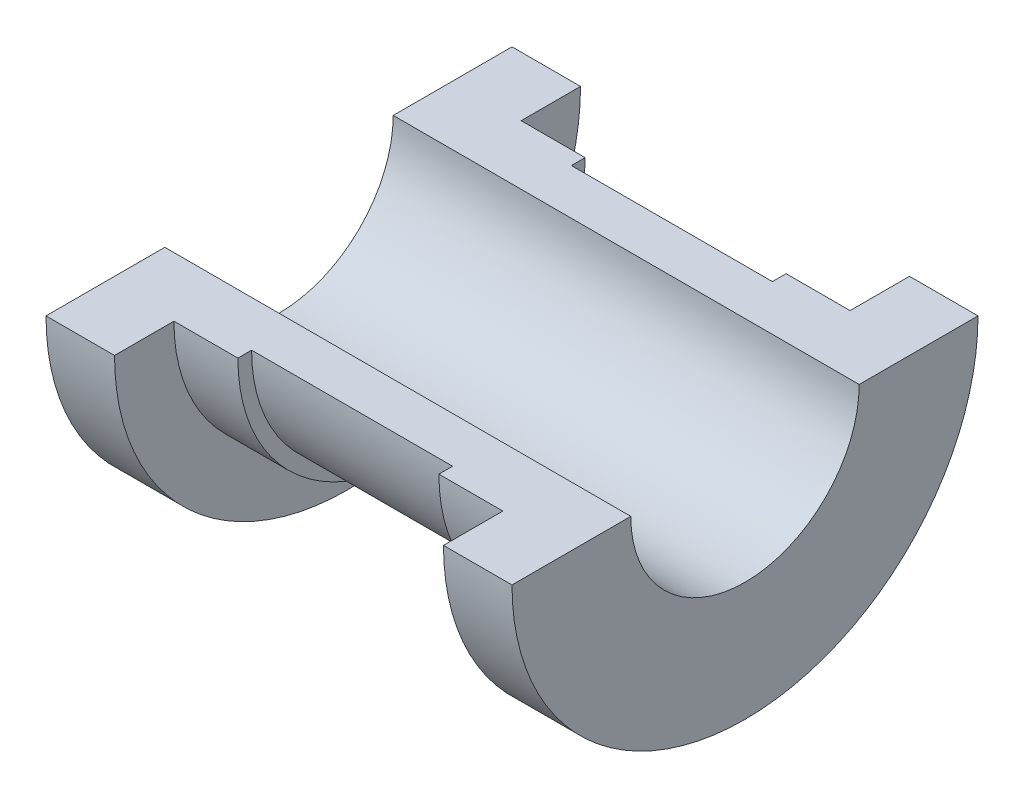
ISO-10303-21;
HEADER;
FILE_DESCRIPTION(('STEP AP214'),'2;1');
FILE_NAME('part.step','',(''),(''),'','','');
FILE_SCHEMA(('AUTOMOTIVE_DESIGN { 1 0 10303 214 1 1 1 1 }'));
ENDSEC;
DATA;
#1=APPLICATION_CONTEXT('core data for automotive mechanical design processes');
#2=APPLICATION_PROTOCOL_DEFINITION('international standard','automotive_design',2000,#1);
#3=PRODUCT_CONTEXT('',#1,'mechanical');
#4=PRODUCT('Part','Part','',(#3));
#5=PRODUCT_RELATED_PRODUCT_CATEGORY('part','',(#4));
#6=PRODUCT_DEFINITION_FORMATION('','',#4);
#7=PRODUCT_DEFINITION_CONTEXT('part definition',#1,'design');
#8=PRODUCT_DEFINITION('design','',#6,#7);
#9=PRODUCT_DEFINITION_SHAPE('','',#8);
#10=(LENGTH_UNIT() NAMED_UNIT(*) SI_UNIT(.MILLI.,.METRE.));
#11=(NAMED_UNIT(*) PLANE_ANGLE_UNIT() SI_UNIT($,.RADIAN.));
#12=(NAMED_UNIT(*) SI_UNIT($,.STERADIAN.) SOLID_ANGLE_UNIT());
#13=UNCERTAINTY_MEASURE_WITH_UNIT(LENGTH_MEASURE(1.E-05),#10,'distance_accuracy_value','');
#14=(GEOMETRIC_REPRESENTATION_CONTEXT(3) GLOBAL_UNCERTAINTY_ASSIGNED_CONTEXT((#13)) GLOBAL_UNIT_ASSIGNED_CONTEXT((#10,
#11,#12)) REPRESENTATION_CONTEXT('',''));
#15=CARTESIAN_POINT('',(0.,0.,0.));
#16=DIRECTION('',(0.,0.,1.));
#17=DIRECTION('',(1.,0.,0.));
#18=AXIS2_PLACEMENT_3D('',#15,#16,#17);
#19=CARTESIAN_POINT('',(0.,-23.5,1.64099622925627E-13));
#20=DIRECTION('',(0.,1.,0.));
#21=DIRECTION('',(0.,0.,1.));
#22=AXIS2_PLACEMENT_3D('',#19,#20,#21);
#23=CYLINDRICAL_SURFACE('',#22,3.);
#24=CARTESIAN_POINT('',(0.,-23.5,1.64099622925627E-13));
#25=DIRECTION('',(0.,-1.,0.));
#26=DIRECTION('',(0.,0.,-1.));
#27=AXIS2_PLACEMENT_3D('',#24,#25,#26);
#28=CIRCLE('',#27,3.);
#29=CARTESIAN_POINT('',(0.,-23.5,-2.99999999999984));
#30=VERTEX_POINT('',#29);
#31=EDGE_CURVE('E11',#30,#30,#28,.T.);
#32=ORIENTED_EDGE('',*,*,#31,.F.);
#33=EDGE_LOOP('',(#32));
#34=FACE_BOUND('',#33,.T.);
#35=CARTESIAN_POINT('',(0.,-17.5,1.2220184685951E-13));
#36=DIRECTION('',(0.,-1.,0.));
#37=DIRECTION('',(0.,0.,-1.));
#38=AXIS2_PLACEMENT_3D('',#35,#36,#37);
#39=CIRCLE('',#38,3.);
#40=CARTESIAN_POINT('',(0.,-17.5,-2.99999999999988));
#41=VERTEX_POINT('',#40);
#42=EDGE_CURVE('E44',#41,#41,#39,.T.);
#43=ORIENTED_EDGE('',*,*,#42,.T.);
#44=EDGE_LOOP('',(#43));
#45=FACE_BOUND('',#44,.T.);
#46=ADVANCED_FACE('F41',(#34,#45),#23,.T.);
#47=CARTESIAN_POINT('',(0.,-23.5,1.64099622925627E-13));
#48=DIRECTION('',(0.,-1.,0.));
#49=DIRECTION('',(0.,0.,-1.));
#50=AXIS2_PLACEMENT_3D('',#47,#48,#49);
#51=PLANE('',#50);
#52=ORIENTED_EDGE('',*,*,#31,.T.);
#53=EDGE_LOOP('',(#52));
#54=FACE_BOUND('',#53,.T.);
#55=ADVANCED_FACE('F56',(#54),#51,.T.);
#56=CARTESIAN_POINT('',(0.,-17.5,1.2220184685951E-13));
#57=DIRECTION('',(0.,-1.,0.));
#58=DIRECTION('',(0.,0.,-1.));
#59=AXIS2_PLACEMENT_3D('',#56,#57,#58);
#60=PLANE('',#59);
#61=ORIENTED_EDGE('',*,*,#42,.F.);
#62=EDGE_LOOP('',(#61));
#63=FACE_BOUND('',#62,.T.);
#64=ADVANCED_FACE('F54',(#63),#60,.F.);
#65=CLOSED_SHELL('',(#46,#55,#64));
#66=MANIFOLD_SOLID_BREP('B2',#65);
#67=CARTESIAN_POINT('',(0.,0.,0.));
#68=DIRECTION('',(0.,1.,0.));
#69=DIRECTION('',(0.,0.,1.));
#70=AXIS2_PLACEMENT_3D('',#67,#68,#69);
#71=PLANE('',#70);
#72=DIRECTION('',(-1.,0.,0.));
#73=VECTOR('',#72,1.);
#74=CARTESIAN_POINT('',(25.5,0.,-12.5));
#75=LINE('',#74,#73);
#76=CARTESIAN_POINT('',(25.5,0.,-12.5));
#77=VERTEX_POINT('',#76);
#78=CARTESIAN_POINT('',(-25.5,0.,-12.5));
#79=VERTEX_POINT('',#78);
#80=EDGE_CURVE('E176',#77,#79,#75,.T.);
#81=ORIENTED_EDGE('',*,*,#80,.F.);
#82=DIRECTION('',(0.,0.,1.));
#83=VECTOR('',#82,1.);
#84=CARTESIAN_POINT('',(25.5,0.,0.));
#85=LINE('',#84,#83);
#86=CARTESIAN_POINT('',(25.5,0.,-25.5));
#87=VERTEX_POINT('',#86);
#88=EDGE_CURVE('E184',#87,#77,#85,.T.);
#89=ORIENTED_EDGE('',*,*,#88,.F.);
#90=DIRECTION('',(-1.,0.,0.));
#91=VECTOR('',#90,1.);
#92=CARTESIAN_POINT('',(25.5,0.,-25.5));
#93=LINE('',#92,#91);
#94=CARTESIAN_POINT('',(18.,0.,-25.5));
#95=VERTEX_POINT('',#94);
#96=EDGE_CURVE('E267',#87,#95,#93,.T.);
#97=ORIENTED_EDGE('',*,*,#96,.T.);
#98=DIRECTION('',(0.,0.,1.));
#99=VECTOR('',#98,1.);
#100=CARTESIAN_POINT('',(18.,0.,-25.5));
#101=LINE('',#100,#99);
#102=CARTESIAN_POINT('',(18.,0.,-19.));
#103=VERTEX_POINT('',#102);
#104=EDGE_CURVE('E264',#95,#103,#101,.T.);
#105=ORIENTED_EDGE('',*,*,#104,.T.);
#106=DIRECTION('',(-1.,0.,0.));
#107=VECTOR('',#106,1.);
#108=CARTESIAN_POINT('',(18.,0.,-19.));
#109=LINE('',#108,#107);
#110=CARTESIAN_POINT('',(11.,0.,-19.));
#111=VERTEX_POINT('',#110);
#112=EDGE_CURVE('E261',#103,#111,#109,.T.);
#113=ORIENTED_EDGE('',*,*,#112,.T.);
#114=DIRECTION('',(0.,0.,1.));
#115=VECTOR('',#114,1.);
#116=CARTESIAN_POINT('',(11.,0.,-19.));
#117=LINE('',#116,#115);
#118=CARTESIAN_POINT('',(11.,0.,-17.5));
#119=VERTEX_POINT('',#118);
#120=EDGE_CURVE('E258',#111,#119,#117,.T.);
#121=ORIENTED_EDGE('',*,*,#120,.T.);
#122=DIRECTION('',(-1.,0.,0.));
#123=VECTOR('',#122,1.);
#124=CARTESIAN_POINT('',(-11.,0.,-17.5));
#125=LINE('',#124,#123);
#126=CARTESIAN_POINT('',(-11.,0.,-17.5));
#127=VERTEX_POINT('',#126);
#128=EDGE_CURVE('E256',#119,#127,#125,.T.);
#129=ORIENTED_EDGE('',*,*,#128,.T.);
#130=DIRECTION('',(0.,0.,-1.));
#131=VECTOR('',#130,1.);
#132=CARTESIAN_POINT('',(-11.,0.,-19.));
#133=LINE('',#132,#131);
#134=CARTESIAN_POINT('',(-11.,0.,-19.));
#135=VERTEX_POINT('',#134);
#136=EDGE_CURVE('E250',#127,#135,#133,.T.);
#137=ORIENTED_EDGE('',*,*,#136,.T.);
#138=DIRECTION('',(-1.,0.,0.));
#139=VECTOR('',#138,1.);
#140=CARTESIAN_POINT('',(-18.,0.,-19.));
#141=LINE('',#140,#139);
#142=CARTESIAN_POINT('',(-18.,0.,-19.));
#143=VERTEX_POINT('',#142);
#144=EDGE_CURVE('E238',#135,#143,#141,.T.);
#145=ORIENTED_EDGE('',*,*,#144,.T.);
#146=DIRECTION('',(0.,0.,-1.));
#147=VECTOR('',#146,1.);
#148=CARTESIAN_POINT('',(-18.,0.,-25.5));
#149=LINE('',#148,#147);
#150=CARTESIAN_POINT('',(-18.,0.,-25.5));
#151=VERTEX_POINT('',#150);
#152=EDGE_CURVE('E247',#143,#151,#149,.T.);
#153=ORIENTED_EDGE('',*,*,#152,.T.);
#154=DIRECTION('',(-1.,0.,0.));
#155=VECTOR('',#154,1.);
#156=CARTESIAN_POINT('',(-25.5,0.,-25.5));
#157=LINE('',#156,#155);
#158=CARTESIAN_POINT('',(-25.5,0.,-25.5));
#159=VERTEX_POINT('',#158);
#160=EDGE_CURVE('E270',#151,#159,#157,.T.);
#161=ORIENTED_EDGE('',*,*,#160,.T.);
#162=DIRECTION('',(0.,0.,-1.));
#163=VECTOR('',#162,1.);
#164=CARTESIAN_POINT('',(-25.5,0.,0.));
#165=LINE('',#164,#163);
#166=EDGE_CURVE('E193',#79,#159,#165,.T.);
#167=ORIENTED_EDGE('',*,*,#166,.F.);
#168=EDGE_LOOP('',(#81,#89,#97,#105,#113,#121,#129,#137,#145,#153,#161,#167));
#169=FACE_BOUND('',#168,.T.);
#170=ADVANCED_FACE('F82',(#169),#71,.T.);
#171=CARTESIAN_POINT('',(25.5,0.,0.));
#172=DIRECTION('',(1.,0.,0.));
#173=DIRECTION('',(0.,0.,-1.));
#174=AXIS2_PLACEMENT_3D('',#171,#172,#173);
#175=CYLINDRICAL_SURFACE('',#174,25.5);
#176=CARTESIAN_POINT('',(-18.,0.,0.));
#177=DIRECTION('',(1.,0.,0.));
#178=DIRECTION('',(0.,0.,-1.));
#179=AXIS2_PLACEMENT_3D('',#176,#177,#178);
#180=CIRCLE('',#179,25.5);
#181=CARTESIAN_POINT('',(-18.,1.78065548281E-13,25.5));
#182=VERTEX_POINT('',#181);
#183=EDGE_CURVE('E39',#182,#151,#180,.T.);
#184=ORIENTED_EDGE('',*,*,#183,.F.);
#185=DIRECTION('',(-1.,0.,0.));
#186=VECTOR('',#185,1.);
#187=CARTESIAN_POINT('',(-25.5,1.78065548281E-13,25.5));
#188=LINE('',#187,#186);
#189=CARTESIAN_POINT('',(-25.5,1.78065548281E-13,25.5));
#190=VERTEX_POINT('',#189);
#191=EDGE_CURVE('E252',#182,#190,#188,.T.);
#192=ORIENTED_EDGE('',*,*,#191,.T.);
#193=CARTESIAN_POINT('',(-25.5,0.,0.));
#194=DIRECTION('',(1.,0.,0.));
#195=DIRECTION('',(0.,0.,-1.));
#196=AXIS2_PLACEMENT_3D('',#193,#194,#195);
#197=CIRCLE('',#196,25.5);
#198=EDGE_CURVE('E218',#190,#159,#197,.T.);
#199=ORIENTED_EDGE('',*,*,#198,.T.);
#200=ORIENTED_EDGE('',*,*,#160,.F.);
#201=EDGE_LOOP('',(#184,#192,#199,#200));
#202=FACE_BOUND('',#201,.T.);
#203=ADVANCED_FACE('F276',(#202),#175,.T.);
#204=CARTESIAN_POINT('',(-18.,1.78065548281E-13,25.5));
#205=DIRECTION('',(1.,0.,0.));
#206=DIRECTION('',(0.,0.,-1.));
#207=AXIS2_PLACEMENT_3D('',#204,#205,#206);
#208=PLANE('',#207);
#209=CARTESIAN_POINT('',(-18.,0.,0.));
#210=DIRECTION('',(1.,0.,0.));
#211=DIRECTION('',(0.,0.,-1.));
#212=AXIS2_PLACEMENT_3D('',#209,#210,#211);
#213=CIRCLE('',#212,19.);
#214=CARTESIAN_POINT('',(-18.,1.32676290876039E-13,19.));
#215=VERTEX_POINT('',#214);
#216=EDGE_CURVE('E90',#215,#143,#213,.T.);
#217=ORIENTED_EDGE('',*,*,#216,.F.);
#218=DIRECTION('',(0.,0.,1.));
#219=VECTOR('',#218,1.);
#220=CARTESIAN_POINT('',(-18.,1.78065548281E-13,25.5));
#221=LINE('',#220,#219);
#222=EDGE_CURVE('E216',#215,#182,#221,.T.);
#223=ORIENTED_EDGE('',*,*,#222,.T.);
#224=ORIENTED_EDGE('',*,*,#183,.T.);
#225=ORIENTED_EDGE('',*,*,#152,.F.);
#226=EDGE_LOOP('',(#217,#223,#224,#225));
#227=FACE_BOUND('',#226,.T.);
#228=ADVANCED_FACE('F84',(#227),#208,.T.);
#229=CARTESIAN_POINT('',(25.5,0.,0.));
#230=DIRECTION('',(1.,0.,0.));
#231=DIRECTION('',(0.,0.,-1.));
#232=AXIS2_PLACEMENT_3D('',#229,#230,#231);
#233=CYLINDRICAL_SURFACE('',#232,19.);
#234=CARTESIAN_POINT('',(-11.,0.,0.));
#235=DIRECTION('',(1.,0.,0.));
#236=DIRECTION('',(0.,0.,-1.));
#237=AXIS2_PLACEMENT_3D('',#234,#235,#236);
#238=CIRCLE('',#237,19.);
#239=CARTESIAN_POINT('',(-11.,1.32676290876039E-13,19.));
#240=VERTEX_POINT('',#239);
#241=EDGE_CURVE('E233',#240,#135,#238,.T.);
#242=ORIENTED_EDGE('',*,*,#241,.F.);
#243=DIRECTION('',(-1.,0.,0.));
#244=VECTOR('',#243,1.);
#245=CARTESIAN_POINT('',(-18.,1.32676290876039E-13,19.));
#246=LINE('',#245,#244);
#247=EDGE_CURVE('E213',#240,#215,#246,.T.);
#248=ORIENTED_EDGE('',*,*,#247,.T.);
#249=ORIENTED_EDGE('',*,*,#216,.T.);
#250=ORIENTED_EDGE('',*,*,#144,.F.);
#251=EDGE_LOOP('',(#242,#248,#249,#250));
#252=FACE_BOUND('',#251,.T.);
#253=ADVANCED_FACE('F237',(#252),#233,.T.);
#254=CARTESIAN_POINT('',(-11.,1.32676290876039E-13,19.));
#255=DIRECTION('',(1.,0.,0.));
#256=DIRECTION('',(0.,0.,-1.));
#257=AXIS2_PLACEMENT_3D('',#254,#255,#256);
#258=PLANE('',#257);
#259=CARTESIAN_POINT('',(-11.,0.,0.));
#260=DIRECTION('',(1.,0.,0.));
#261=DIRECTION('',(0.,0.,-1.));
#262=AXIS2_PLACEMENT_3D('',#259,#260,#261);
#263=CIRCLE('',#262,17.5);
#264=CARTESIAN_POINT('',(-11.,1.2220184685951E-13,17.5));
#265=VERTEX_POINT('',#264);
#266=EDGE_CURVE('E231',#265,#127,#263,.T.);
#267=ORIENTED_EDGE('',*,*,#266,.F.);
#268=DIRECTION('',(0.,0.,1.));
#269=VECTOR('',#268,1.);
#270=CARTESIAN_POINT('',(-11.,1.32676290876039E-13,19.));
#271=LINE('',#270,#269);
#272=EDGE_CURVE('E210',#265,#240,#271,.T.);
#273=ORIENTED_EDGE('',*,*,#272,.T.);
#274=ORIENTED_EDGE('',*,*,#241,.T.);
#275=ORIENTED_EDGE('',*,*,#136,.F.);
#276=EDGE_LOOP('',(#267,#273,#274,#275));
#277=FACE_BOUND('',#276,.T.);
#278=ADVANCED_FACE('F282',(#277),#258,.T.);
#279=CARTESIAN_POINT('',(25.5,0.,0.));
#280=DIRECTION('',(1.,0.,0.));
#281=DIRECTION('',(0.,0.,-1.));
#282=AXIS2_PLACEMENT_3D('',#279,#280,#281);
#283=CYLINDRICAL_SURFACE('',#282,17.5);
#284=CARTESIAN_POINT('',(11.,0.,0.));
#285=DIRECTION('',(1.,0.,0.));
#286=DIRECTION('',(0.,0.,-1.));
#287=AXIS2_PLACEMENT_3D('',#284,#285,#286);
#288=CIRCLE('',#287,17.5);
#289=CARTESIAN_POINT('',(11.,1.2220184685951E-13,17.5));
#290=VERTEX_POINT('',#289);
#291=EDGE_CURVE('E229',#290,#119,#288,.T.);
#292=ORIENTED_EDGE('',*,*,#291,.F.);
#293=DIRECTION('',(-1.,0.,0.));
#294=VECTOR('',#293,1.);
#295=CARTESIAN_POINT('',(-11.,1.2220184685951E-13,17.5));
#296=LINE('',#295,#294);
#297=EDGE_CURVE('E207',#290,#265,#296,.T.);
#298=ORIENTED_EDGE('',*,*,#297,.T.);
#299=ORIENTED_EDGE('',*,*,#266,.T.);
#300=ORIENTED_EDGE('',*,*,#128,.F.);
#301=EDGE_LOOP('',(#292,#298,#299,#300));
#302=FACE_BOUND('',#301,.T.);
#303=ADVANCED_FACE('F285',(#302),#283,.T.);
#304=CARTESIAN_POINT('',(11.,1.32676290876039E-13,19.));
#305=DIRECTION('',(-1.,0.,0.));
#306=DIRECTION('',(0.,0.,1.));
#307=AXIS2_PLACEMENT_3D('',#304,#305,#306);
#308=PLANE('',#307);
#309=CARTESIAN_POINT('',(11.,0.,0.));
#310=DIRECTION('',(1.,0.,0.));
#311=DIRECTION('',(0.,0.,-1.));
#312=AXIS2_PLACEMENT_3D('',#309,#310,#311);
#313=CIRCLE('',#312,19.);
#314=CARTESIAN_POINT('',(11.,1.32676290876039E-13,19.));
#315=VERTEX_POINT('',#314);
#316=EDGE_CURVE('E227',#315,#111,#313,.T.);
#317=ORIENTED_EDGE('',*,*,#316,.F.);
#318=DIRECTION('',(0.,0.,-1.));
#319=VECTOR('',#318,1.);
#320=CARTESIAN_POINT('',(11.,1.32676290876039E-13,19.));
#321=LINE('',#320,#319);
#322=EDGE_CURVE('E204',#315,#290,#321,.T.);
#323=ORIENTED_EDGE('',*,*,#322,.T.);
#324=ORIENTED_EDGE('',*,*,#291,.T.);
#325=ORIENTED_EDGE('',*,*,#120,.F.);
#326=EDGE_LOOP('',(#317,#323,#324,#325));
#327=FACE_BOUND('',#326,.T.);
#328=ADVANCED_FACE('F288',(#327),#308,.T.);
#329=CARTESIAN_POINT('',(25.5,0.,0.));
#330=DIRECTION('',(1.,0.,0.));
#331=DIRECTION('',(0.,0.,-1.));
#332=AXIS2_PLACEMENT_3D('',#329,#330,#331);
#333=CYLINDRICAL_SURFACE('',#332,19.);
#334=CARTESIAN_POINT('',(18.,0.,0.));
#335=DIRECTION('',(1.,0.,0.));
#336=DIRECTION('',(0.,0.,-1.));
#337=AXIS2_PLACEMENT_3D('',#334,#335,#336);
#338=CIRCLE('',#337,19.);
#339=CARTESIAN_POINT('',(18.,1.32676290876039E-13,19.));
#340=VERTEX_POINT('',#339);
#341=EDGE_CURVE('E225',#340,#103,#338,.T.);
#342=ORIENTED_EDGE('',*,*,#341,.F.);
#343=DIRECTION('',(-1.,0.,0.));
#344=VECTOR('',#343,1.);
#345=CARTESIAN_POINT('',(18.,1.32676290876039E-13,19.));
#346=LINE('',#345,#344);
#347=EDGE_CURVE('E201',#340,#315,#346,.T.);
#348=ORIENTED_EDGE('',*,*,#347,.T.);
#349=ORIENTED_EDGE('',*,*,#316,.T.);
#350=ORIENTED_EDGE('',*,*,#112,.F.);
#351=EDGE_LOOP('',(#342,#348,#349,#350));
#352=FACE_BOUND('',#351,.T.);
#353=ADVANCED_FACE('F291',(#352),#333,.T.);
#354=CARTESIAN_POINT('',(18.,1.78065548281E-13,25.5));
#355=DIRECTION('',(-1.,0.,0.));
#356=DIRECTION('',(0.,0.,1.));
#357=AXIS2_PLACEMENT_3D('',#354,#355,#356);
#358=PLANE('',#357);
#359=CARTESIAN_POINT('',(18.,0.,0.));
#360=DIRECTION('',(1.,0.,0.));
#361=DIRECTION('',(0.,0.,-1.));
#362=AXIS2_PLACEMENT_3D('',#359,#360,#361);
#363=CIRCLE('',#362,25.5);
#364=CARTESIAN_POINT('',(18.,1.78065548281E-13,25.5));
#365=VERTEX_POINT('',#364);
#366=EDGE_CURVE('E223',#365,#95,#363,.T.);
#367=ORIENTED_EDGE('',*,*,#366,.F.);
#368=DIRECTION('',(0.,0.,-1.));
#369=VECTOR('',#368,1.);
#370=CARTESIAN_POINT('',(18.,1.78065548281E-13,25.5));
#371=LINE('',#370,#369);
#372=EDGE_CURVE('E198',#365,#340,#371,.T.);
#373=ORIENTED_EDGE('',*,*,#372,.T.);
#374=ORIENTED_EDGE('',*,*,#341,.T.);
#375=ORIENTED_EDGE('',*,*,#104,.F.);
#376=EDGE_LOOP('',(#367,#373,#374,#375));
#377=FACE_BOUND('',#376,.T.);
#378=ADVANCED_FACE('F295',(#377),#358,.T.);
#379=CARTESIAN_POINT('',(25.5,0.,0.));
#380=DIRECTION('',(1.,0.,0.));
#381=DIRECTION('',(0.,0.,-1.));
#382=AXIS2_PLACEMENT_3D('',#379,#380,#381);
#383=CYLINDRICAL_SURFACE('',#382,25.5);
#384=CARTESIAN_POINT('',(25.5,0.,0.));
#385=DIRECTION('',(1.,0.,0.));
#386=DIRECTION('',(0.,0.,-1.));
#387=AXIS2_PLACEMENT_3D('',#384,#385,#386);
#388=CIRCLE('',#387,25.5);
#389=CARTESIAN_POINT('',(25.5,1.78065548281E-13,25.5));
#390=VERTEX_POINT('',#389);
#391=EDGE_CURVE('E221',#390,#87,#388,.T.);
#392=ORIENTED_EDGE('',*,*,#391,.F.);
#393=DIRECTION('',(-1.,0.,0.));
#394=VECTOR('',#393,1.);
#395=CARTESIAN_POINT('',(25.5,1.78065548281E-13,25.5));
#396=LINE('',#395,#394);
#397=EDGE_CURVE('E190',#390,#365,#396,.T.);
#398=ORIENTED_EDGE('',*,*,#397,.T.);
#399=ORIENTED_EDGE('',*,*,#366,.T.);
#400=ORIENTED_EDGE('',*,*,#96,.F.);
#401=EDGE_LOOP('',(#392,#398,#399,#400));
#402=FACE_BOUND('',#401,.T.);
#403=ADVANCED_FACE('F298',(#402),#383,.T.);
#404=CARTESIAN_POINT('',(25.5,0.,0.));
#405=DIRECTION('',(1.,0.,0.));
#406=DIRECTION('',(0.,0.,-1.));
#407=AXIS2_PLACEMENT_3D('',#404,#405,#406);
#408=PLANE('',#407);
#409=CARTESIAN_POINT('',(25.5,0.,0.));
#410=DIRECTION('',(-1.,0.,0.));
#411=DIRECTION('',(0.,0.,1.));
#412=AXIS2_PLACEMENT_3D('',#409,#410,#411);
#413=CIRCLE('',#412,12.5);
#414=CARTESIAN_POINT('',(25.5,1.32676290876039E-13,12.5));
#415=VERTEX_POINT('',#414);
#416=EDGE_CURVE('E170',#77,#415,#413,.T.);
#417=ORIENTED_EDGE('',*,*,#416,.T.);
#418=EDGE_CURVE('E182',#415,#390,#85,.T.);
#419=ORIENTED_EDGE('',*,*,#418,.T.);
#420=ORIENTED_EDGE('',*,*,#391,.T.);
#421=ORIENTED_EDGE('',*,*,#88,.T.);
#422=EDGE_LOOP('',(#417,#419,#420,#421));
#423=FACE_BOUND('',#422,.T.);
#424=ADVANCED_FACE('F180',(#423),#408,.T.);
#425=CARTESIAN_POINT('',(-25.5,0.,0.));
#426=DIRECTION('',(-1.,0.,0.));
#427=DIRECTION('',(0.,0.,1.));
#428=AXIS2_PLACEMENT_3D('',#425,#426,#427);
#429=PLANE('',#428);
#430=CARTESIAN_POINT('',(-25.5,0.,0.));
#431=DIRECTION('',(-1.,0.,0.));
#432=DIRECTION('',(0.,0.,1.));
#433=AXIS2_PLACEMENT_3D('',#430,#431,#432);
#434=CIRCLE('',#433,12.5);
#435=CARTESIAN_POINT('',(-25.5,0.,12.5));
#436=VERTEX_POINT('',#435);
#437=EDGE_CURVE('E97',#79,#436,#434,.T.);
#438=ORIENTED_EDGE('',*,*,#437,.F.);
#439=ORIENTED_EDGE('',*,*,#166,.T.);
#440=ORIENTED_EDGE('',*,*,#198,.F.);
#441=EDGE_CURVE('E191',#190,#436,#165,.T.);
#442=ORIENTED_EDGE('',*,*,#441,.T.);
#443=EDGE_LOOP('',(#438,#439,#440,#442));
#444=FACE_BOUND('',#443,.T.);
#445=ADVANCED_FACE('F275',(#444),#429,.T.);
#446=DIRECTION('',(-1.,0.,0.));
#447=VECTOR('',#446,1.);
#448=CARTESIAN_POINT('',(25.5,1.32676290876039E-13,12.5));
#449=LINE('',#448,#447);
#450=EDGE_CURVE('E167',#415,#436,#449,.T.);
#451=ORIENTED_EDGE('',*,*,#450,.T.);
#452=ORIENTED_EDGE('',*,*,#441,.F.);
#453=ORIENTED_EDGE('',*,*,#191,.F.);
#454=ORIENTED_EDGE('',*,*,#222,.F.);
#455=ORIENTED_EDGE('',*,*,#247,.F.);
#456=ORIENTED_EDGE('',*,*,#272,.F.);
#457=ORIENTED_EDGE('',*,*,#297,.F.);
#458=ORIENTED_EDGE('',*,*,#322,.F.);
#459=ORIENTED_EDGE('',*,*,#347,.F.);
#460=ORIENTED_EDGE('',*,*,#372,.F.);
#461=ORIENTED_EDGE('',*,*,#397,.F.);
#462=ORIENTED_EDGE('',*,*,#418,.F.);
#463=EDGE_LOOP('',(#451,#452,#453,#454,#455,#456,#457,#458,#459,#460,#461,#462));
#464=FACE_BOUND('',#463,.T.);
#465=ADVANCED_FACE('F187',(#464),#71,.T.);
#466=CARTESIAN_POINT('',(25.5,0.,0.));
#467=DIRECTION('',(-1.,0.,0.));
#468=DIRECTION('',(0.,0.,1.));
#469=AXIS2_PLACEMENT_3D('',#466,#467,#468);
#470=CYLINDRICAL_SURFACE('',#469,12.5);
#471=ORIENTED_EDGE('',*,*,#437,.T.);
#472=ORIENTED_EDGE('',*,*,#450,.F.);
#473=ORIENTED_EDGE('',*,*,#416,.F.);
#474=ORIENTED_EDGE('',*,*,#80,.T.);
#475=EDGE_LOOP('',(#471,#472,#473,#474));
#476=FACE_BOUND('',#475,.T.);
#477=ADVANCED_FACE('F169',(#476),#470,.F.);
#478=CLOSED_SHELL('',(#170,#203,#228,#253,#278,#303,#328,#353,#378,#403,#424,#445,#465,#477));
#479=MANIFOLD_SOLID_BREP('B6',#478);
#480=ADVANCED_BREP_SHAPE_REPRESENTATION('',(#18,#66,#479),#14);
#481=SHAPE_DEFINITION_REPRESENTATION(#9,#480);
ENDSEC;
END-ISO-10303-21;
